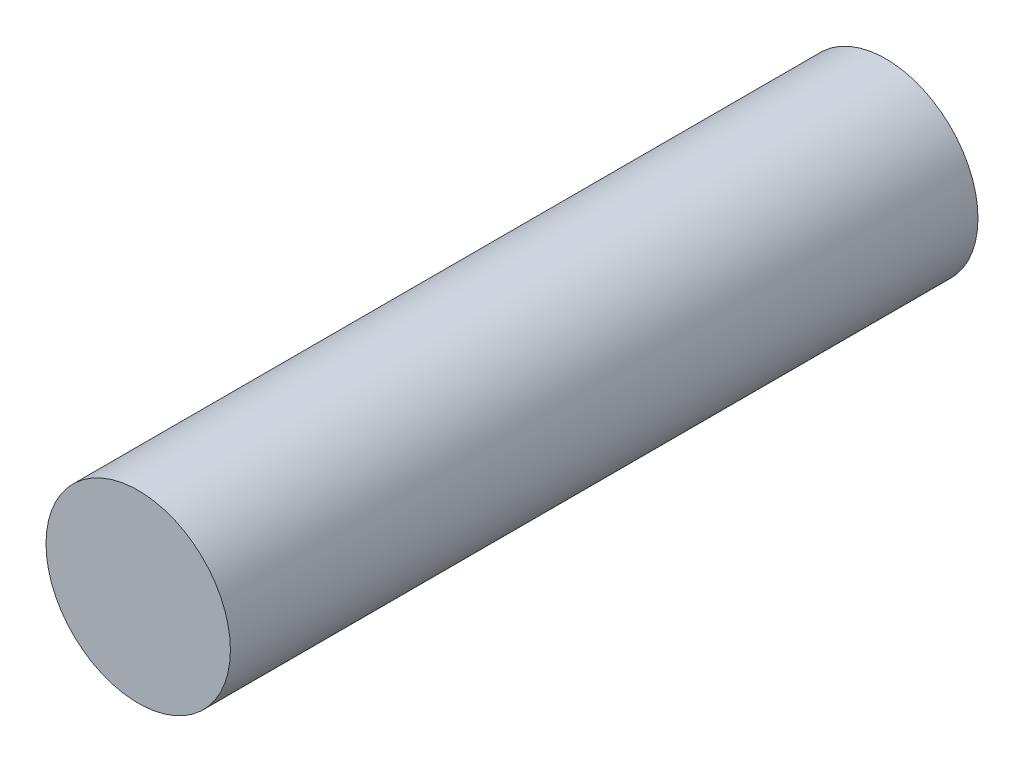
ISO-10303-21;
HEADER;
FILE_DESCRIPTION(('STEP AP214'),'2;1');
FILE_NAME('part.step','',(''),(''),'','','');
FILE_SCHEMA(('AUTOMOTIVE_DESIGN { 1 0 10303 214 1 1 1 1 }'));
ENDSEC;
DATA;
#1=APPLICATION_CONTEXT('core data for automotive mechanical design processes');
#2=APPLICATION_PROTOCOL_DEFINITION('international standard','automotive_design',2000,#1);
#3=PRODUCT_CONTEXT('',#1,'mechanical');
#4=PRODUCT('Part','Part','',(#3));
#5=PRODUCT_RELATED_PRODUCT_CATEGORY('part','',(#4));
#6=PRODUCT_DEFINITION_FORMATION('','',#4);
#7=PRODUCT_DEFINITION_CONTEXT('part definition',#1,'design');
#8=PRODUCT_DEFINITION('design','',#6,#7);
#9=PRODUCT_DEFINITION_SHAPE('','',#8);
#10=(LENGTH_UNIT() NAMED_UNIT(*) SI_UNIT(.MILLI.,.METRE.));
#11=(NAMED_UNIT(*) PLANE_ANGLE_UNIT() SI_UNIT($,.RADIAN.));
#12=(NAMED_UNIT(*) SI_UNIT($,.STERADIAN.) SOLID_ANGLE_UNIT());
#13=UNCERTAINTY_MEASURE_WITH_UNIT(LENGTH_MEASURE(1.E-05),#10,'distance_accuracy_value','');
#14=(GEOMETRIC_REPRESENTATION_CONTEXT(3) GLOBAL_UNCERTAINTY_ASSIGNED_CONTEXT((#13)) GLOBAL_UNIT_ASSIGNED_CONTEXT((#10,
#11,#12)) REPRESENTATION_CONTEXT('',''));
#15=CARTESIAN_POINT('',(0.,0.,0.));
#16=DIRECTION('',(0.,0.,1.));
#17=DIRECTION('',(1.,0.,0.));
#18=AXIS2_PLACEMENT_3D('',#15,#16,#17);
#19=CARTESIAN_POINT('',(0.,0.,38.1));
#20=DIRECTION('',(0.,0.,-1.));
#21=DIRECTION('',(-1.,0.,0.));
#22=AXIS2_PLACEMENT_3D('',#19,#20,#21);
#23=CYLINDRICAL_SURFACE('',#22,4.699);
#24=CARTESIAN_POINT('',(0.,0.,38.1));
#25=DIRECTION('',(0.,0.,1.));
#26=DIRECTION('',(1.,0.,0.));
#27=AXIS2_PLACEMENT_3D('',#24,#25,#26);
#28=CIRCLE('',#27,4.699);
#29=CARTESIAN_POINT('',(4.69899999999999,0.,38.1));
#30=VERTEX_POINT('',#29);
#31=EDGE_CURVE('E12',#30,#30,#28,.T.);
#32=ORIENTED_EDGE('',*,*,#31,.F.);
#33=EDGE_LOOP('',(#32));
#34=FACE_BOUND('',#33,.T.);
#35=CARTESIAN_POINT('',(0.,0.,0.));
#36=DIRECTION('',(0.,0.,1.));
#37=DIRECTION('',(1.,0.,0.));
#38=AXIS2_PLACEMENT_3D('',#35,#36,#37);
#39=CIRCLE('',#38,4.699);
#40=CARTESIAN_POINT('',(4.699,0.,0.));
#41=VERTEX_POINT('',#40);
#42=EDGE_CURVE('E44',#41,#41,#39,.T.);
#43=ORIENTED_EDGE('',*,*,#42,.T.);
#44=EDGE_LOOP('',(#43));
#45=FACE_BOUND('',#44,.T.);
#46=ADVANCED_FACE('F41',(#34,#45),#23,.T.);
#47=CARTESIAN_POINT('',(0.,0.,38.1));
#48=DIRECTION('',(0.,0.,1.));
#49=DIRECTION('',(1.,0.,0.));
#50=AXIS2_PLACEMENT_3D('',#47,#48,#49);
#51=PLANE('',#50);
#52=ORIENTED_EDGE('',*,*,#31,.T.);
#53=EDGE_LOOP('',(#52));
#54=FACE_BOUND('',#53,.T.);
#55=ADVANCED_FACE('F56',(#54),#51,.T.);
#56=CARTESIAN_POINT('',(0.,0.,0.));
#57=DIRECTION('',(0.,0.,1.));
#58=DIRECTION('',(1.,0.,0.));
#59=AXIS2_PLACEMENT_3D('',#56,#57,#58);
#60=PLANE('',#59);
#61=ORIENTED_EDGE('',*,*,#42,.F.);
#62=EDGE_LOOP('',(#61));
#63=FACE_BOUND('',#62,.T.);
#64=ADVANCED_FACE('F54',(#63),#60,.F.);
#65=CLOSED_SHELL('',(#46,#55,#64));
#66=MANIFOLD_SOLID_BREP('B2',#65);
#67=ADVANCED_BREP_SHAPE_REPRESENTATION('',(#18,#66),#14);
#68=SHAPE_DEFINITION_REPRESENTATION(#9,#67);
ENDSEC;
END-ISO-10303-21;
